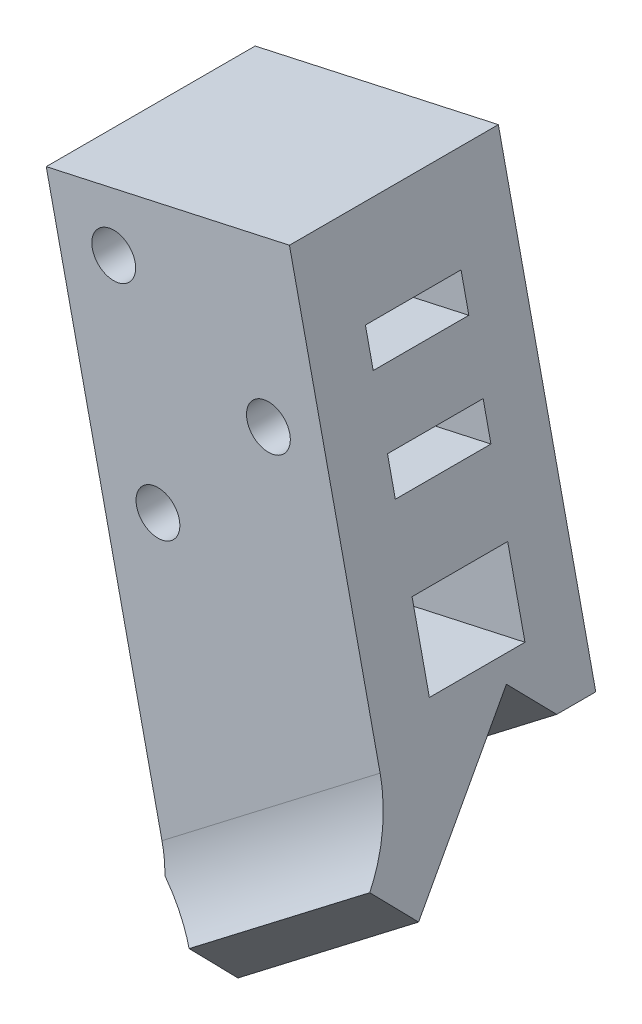
ISO-10303-21;
HEADER;
FILE_DESCRIPTION(('STEP AP214'),'2;1');
FILE_NAME('part.step','',(''),(''),'','','');
FILE_SCHEMA(('AUTOMOTIVE_DESIGN { 1 0 10303 214 1 1 1 1 }'));
ENDSEC;
DATA;
#1=APPLICATION_CONTEXT('core data for automotive mechanical design processes');
#2=APPLICATION_PROTOCOL_DEFINITION('international standard','automotive_design',2000,#1);
#3=PRODUCT_CONTEXT('',#1,'mechanical');
#4=PRODUCT('Part','Part','',(#3));
#5=PRODUCT_RELATED_PRODUCT_CATEGORY('part','',(#4));
#6=PRODUCT_DEFINITION_FORMATION('','',#4);
#7=PRODUCT_DEFINITION_CONTEXT('part definition',#1,'design');
#8=PRODUCT_DEFINITION('design','',#6,#7);
#9=PRODUCT_DEFINITION_SHAPE('','',#8);
#10=(LENGTH_UNIT() NAMED_UNIT(*) SI_UNIT(.MILLI.,.METRE.));
#11=(NAMED_UNIT(*) PLANE_ANGLE_UNIT() SI_UNIT($,.RADIAN.));
#12=(NAMED_UNIT(*) SI_UNIT($,.STERADIAN.) SOLID_ANGLE_UNIT());
#13=UNCERTAINTY_MEASURE_WITH_UNIT(LENGTH_MEASURE(1.E-05),#10,'distance_accuracy_value','');
#14=(GEOMETRIC_REPRESENTATION_CONTEXT(3) GLOBAL_UNCERTAINTY_ASSIGNED_CONTEXT((#13)) GLOBAL_UNIT_ASSIGNED_CONTEXT((#10,
#11,#12)) REPRESENTATION_CONTEXT('',''));
#15=CARTESIAN_POINT('',(0.,0.,0.));
#16=DIRECTION('',(0.,0.,1.));
#17=DIRECTION('',(1.,0.,0.));
#18=AXIS2_PLACEMENT_3D('',#15,#16,#17);
#19=CARTESIAN_POINT('',(-430.644730128089,-3182.63466231102,22.099700245719));
#20=DIRECTION('',(-0.41963660019663,0.5462628016859,0.724915219366848));
#21=DIRECTION('',(0.,-0.798635508908396,0.601815024663416));
#22=AXIS2_PLACEMENT_3D('',#19,#20,#21);
#23=PLANE('',#22);
#24=DIRECTION('',(0.793020599570287,0.609194819952684,-1.14540626299615E-09));
#25=VECTOR('',#24,1.);
#26=CARTESIAN_POINT('',(-430.644730128089,-3182.63466231102,22.099700245719));
#27=LINE('',#26,#25);
#28=CARTESIAN_POINT('',(-431.576719114451,-3183.35061201403,22.0997002470651));
#29=VERTEX_POINT('',#28);
#30=CARTESIAN_POINT('',(-411.328388685969,-3167.79593662165,22.0997002120419));
#31=VERTEX_POINT('',#30);
#32=EDGE_CURVE('E398',#29,#31,#27,.T.);
#33=ORIENTED_EDGE('',*,*,#32,.F.);
#34=DIRECTION('',(0.764332976711528,-0.21811145207351,0.606813394039452));
#35=VECTOR('',#34,1.);
#36=CARTESIAN_POINT('',(-190.519660023296,-3252.1390939884,213.477877875374));
#37=LINE('',#36,#35);
#38=CARTESIAN_POINT('',(-436.818938160454,-3181.85468282867,17.9378377738104));
#39=VERTEX_POINT('',#38);
#40=EDGE_CURVE('E491',#29,#39,#37,.F.);
#41=ORIENTED_EDGE('',*,*,#40,.T.);
#42=DIRECTION('',(-0.162934904586066,0.740330648362003,-0.652198396167475));
#43=VECTOR('',#42,1.);
#44=CARTESIAN_POINT('',(-437.492369636501,-3178.79479849905,15.2422156802948));
#45=LINE('',#44,#43);
#46=CARTESIAN_POINT('',(-439.05748820437,-3171.68333734801,8.9773344860411));
#47=VERTEX_POINT('',#46);
#48=EDGE_CURVE('E390',#39,#47,#45,.T.);
#49=ORIENTED_EDGE('',*,*,#48,.T.);
#50=DIRECTION('',(0.793020599570287,0.609194819952684,-1.14540626299615E-09));
#51=VECTOR('',#50,1.);
#52=CARTESIAN_POINT('',(-439.057488204156,-3171.68333734898,8.9773344860915));
#53=LINE('',#52,#51);
#54=CARTESIAN_POINT('',(-414.606672451435,-3152.90033182925,8.97733445190054));
#55=VERTEX_POINT('',#54);
#56=EDGE_CURVE('E393',#47,#55,#53,.T.);
#57=ORIENTED_EDGE('',*,*,#56,.T.);
#58=DIRECTION('',(-0.162934904566504,0.740330648273025,-0.652198396273363));
#59=VECTOR('',#58,1.);
#60=CARTESIAN_POINT('',(-410.051263001116,-3173.59883863769,27.2117989809765));
#61=LINE('',#60,#59);
#62=EDGE_CURVE('E388',#31,#55,#61,.T.);
#63=ORIENTED_EDGE('',*,*,#62,.F.);
#64=EDGE_LOOP('',(#33,#41,#49,#57,#63));
#65=FACE_BOUND('',#64,.T.);
#66=ADVANCED_FACE('F40',(#65),#23,.F.);
#67=CARTESIAN_POINT('',(730.719316566678,-951.215358792421,1139.78864635279));
#68=DIRECTION('',(-0.441614597168833,0.574872701419261,-0.688838097618251));
#69=DIRECTION('',(0.,0.767760111423423,0.640737396526138));
#70=AXIS2_PLACEMENT_3D('',#67,#68,#69);
#71=PLANE('',#70);
#72=DIRECTION('',(-0.793020599396075,-0.609194820179464,8.44456975149217E-10));
#73=VECTOR('',#72,1.);
#74=CARTESIAN_POINT('',(-407.202840466044,-3159.26737875755,26.572351761195));
#75=LINE('',#74,#73);
#76=CARTESIAN_POINT('',(-412.337314757425,-3163.21165857202,26.5723517666625));
#77=VERTEX_POINT('',#76);
#78=CARTESIAN_POINT('',(-432.585645199395,-3178.76633398893,26.5723517882242));
#79=VERTEX_POINT('',#78);
#80=EDGE_CURVE('E394',#77,#79,#75,.T.);
#81=ORIENTED_EDGE('',*,*,#80,.T.);
#82=DIRECTION('',(0.155610020400119,-0.707048422725113,-0.689831899431307));
#83=VECTOR('',#82,1.);
#84=CARTESIAN_POINT('',(-768.998420111875,-1650.20074884962,1517.91759365708));
#85=LINE('',#84,#83);
#86=EDGE_CURVE('E486',#79,#29,#85,.T.);
#87=ORIENTED_EDGE('',*,*,#86,.T.);
#88=ORIENTED_EDGE('',*,*,#32,.T.);
#89=DIRECTION('',(0.155610020400137,-0.707048422725105,-0.689831899431311));
#90=VECTOR('',#89,1.);
#91=CARTESIAN_POINT('',(-747.529007650291,-1640.19432879024,1512.50443747787));
#92=LINE('',#91,#90);
#93=EDGE_CURVE('E440',#77,#31,#92,.T.);
#94=ORIENTED_EDGE('',*,*,#93,.F.);
#95=EDGE_LOOP('',(#81,#87,#88,#94));
#96=FACE_BOUND('',#95,.T.);
#97=ADVANCED_FACE('F509',(#96),#71,.F.);
#98=CARTESIAN_POINT('',(1369.31075164133,-1782.50307535107,8.97733187412308));
#99=DIRECTION('',(0.441614597168841,-0.574872701419268,0.68883809761824));
#100=DIRECTION('',(-0.793020599570295,-0.609194819952673,1.14542203499823E-09));
#101=AXIS2_PLACEMENT_3D('',#98,#99,#100);
#102=PLANE('',#101);
#103=DIRECTION('',(-0.155610020400138,0.707048422725093,0.689831899431323));
#104=VECTOR('',#103,1.);
#105=CARTESIAN_POINT('',(-419.136446570394,-3132.31830479862,29.0581922017582));
#106=LINE('',#105,#104);
#107=CARTESIAN_POINT('',(-413.56829504717,-3157.61842841449,4.37412281014464));
#108=VERTEX_POINT('',#107);
#109=EDGE_CURVE('E404',#108,#55,#106,.T.);
#110=ORIENTED_EDGE('',*,*,#109,.T.);
#111=ORIENTED_EDGE('',*,*,#56,.F.);
#112=DIRECTION('',(0.155610020400135,-0.707048422725094,-0.689831899431322));
#113=VECTOR('',#112,1.);
#114=CARTESIAN_POINT('',(-444.660319490352,-3146.22563858695,33.8151420926411));
#115=LINE('',#114,#113);
#116=CARTESIAN_POINT('',(-438.01911079961,-3176.4014339355,4.37412284546019));
#117=VERTEX_POINT('',#116);
#118=EDGE_CURVE('E400',#47,#117,#115,.T.);
#119=ORIENTED_EDGE('',*,*,#118,.T.);
#120=DIRECTION('',(0.793020599570291,0.609194819952678,-1.1454154752367E-09));
#121=VECTOR('',#120,1.);
#122=CARTESIAN_POINT('',(-438.019110846727,-3176.40143397169,4.37412284546063));
#123=LINE('',#122,#121);
#124=EDGE_CURVE('E409',#117,#108,#123,.T.);
#125=ORIENTED_EDGE('',*,*,#124,.T.);
#126=EDGE_LOOP('',(#110,#111,#119,#125));
#127=FACE_BOUND('',#126,.T.);
#128=ADVANCED_FACE('F539',(#127),#102,.T.);
#129=CARTESIAN_POINT('',(-424.487246991543,-3108.00576381726,4.3688));
#130=DIRECTION('',(0.214939998904944,-0.97662725585084,0.));
#131=DIRECTION('',(0.97662725585084,0.214939998904944,0.));
#132=AXIS2_PLACEMENT_3D('',#129,#130,#131);
#133=PLANE('',#132);
#134=DIRECTION('',(-0.97662725585084,-0.214939998904944,0.));
#135=VECTOR('',#134,1.);
#136=CARTESIAN_POINT('',(-424.487246991543,-3108.00576381726,0.));
#137=LINE('',#136,#135);
#138=CARTESIAN_POINT('',(-424.487246991543,-3108.00576381726,0.));
#139=VERTEX_POINT('',#138);
#140=CARTESIAN_POINT('',(-451.751312835365,-3114.00614753326,0.));
#141=VERTEX_POINT('',#140);
#142=EDGE_CURVE('E408',#139,#141,#137,.T.);
#143=ORIENTED_EDGE('',*,*,#142,.T.);
#144=DIRECTION('',(0.,0.,-1.));
#145=VECTOR('',#144,1.);
#146=CARTESIAN_POINT('',(-451.751312835365,-3114.00614753326,4.3688));
#147=LINE('',#146,#145);
#148=CARTESIAN_POINT('',(-451.751312835365,-3114.00614753326,23.4188));
#149=VERTEX_POINT('',#148);
#150=EDGE_CURVE('E437',#149,#141,#147,.T.);
#151=ORIENTED_EDGE('',*,*,#150,.F.);
#152=DIRECTION('',(-0.97662725585084,-0.214939998904944,0.));
#153=VECTOR('',#152,1.);
#154=CARTESIAN_POINT('',(-424.487246991543,-3108.00576381726,23.4188));
#155=LINE('',#154,#153);
#156=CARTESIAN_POINT('',(-424.487246991543,-3108.00576381726,23.4188));
#157=VERTEX_POINT('',#156);
#158=EDGE_CURVE('E385',#157,#149,#155,.T.);
#159=ORIENTED_EDGE('',*,*,#158,.F.);
#160=DIRECTION('',(0.,0.,-1.));
#161=VECTOR('',#160,1.);
#162=CARTESIAN_POINT('',(-424.487246991543,-3108.00576381726,4.3688));
#163=LINE('',#162,#161);
#164=EDGE_CURVE('E427',#157,#139,#163,.T.);
#165=ORIENTED_EDGE('',*,*,#164,.T.);
#166=EDGE_LOOP('',(#143,#151,#159,#165));
#167=FACE_BOUND('',#166,.T.);
#168=ADVANCED_FACE('F466',(#167),#133,.F.);
#169=CARTESIAN_POINT('',(-451.751312835365,-3114.00614753326,4.3688));
#170=DIRECTION('',(0.976627255850845,0.214939998904922,0.));
#171=DIRECTION('',(-0.214939998904922,0.976627255850845,0.));
#172=AXIS2_PLACEMENT_3D('',#169,#170,#171);
#173=PLANE('',#172);
#174=DIRECTION('',(0.,0.,1.));
#175=VECTOR('',#174,1.);
#176=CARTESIAN_POINT('',(-447.107596252733,-3135.10589725947,4.3688));
#177=LINE('',#176,#175);
#178=CARTESIAN_POINT('',(-447.107596252733,-3135.10589725947,6.35000000000001));
#179=VERTEX_POINT('',#178);
#180=CARTESIAN_POINT('',(-447.107596252733,-3135.10589725947,17.0688));
#181=VERTEX_POINT('',#180);
#182=EDGE_CURVE('E346',#179,#181,#177,.T.);
#183=ORIENTED_EDGE('',*,*,#182,.T.);
#184=DIRECTION('',(0.214939998904922,-0.976627255850845,0.));
#185=VECTOR('',#184,1.);
#186=CARTESIAN_POINT('',(-451.751312835365,-3114.00614753326,17.0688));
#187=LINE('',#186,#185);
#188=CARTESIAN_POINT('',(-446.232282959902,-3139.08307611655,17.0688));
#189=VERTEX_POINT('',#188);
#190=EDGE_CURVE('E350',#181,#189,#187,.T.);
#191=ORIENTED_EDGE('',*,*,#190,.T.);
#192=DIRECTION('',(0.,0.,-1.));
#193=VECTOR('',#192,1.);
#194=CARTESIAN_POINT('',(-446.232282959902,-3139.08307611655,4.3688));
#195=LINE('',#194,#193);
#196=CARTESIAN_POINT('',(-446.232282959902,-3139.08307611655,6.35000000000001));
#197=VERTEX_POINT('',#196);
#198=EDGE_CURVE('E338',#189,#197,#195,.T.);
#199=ORIENTED_EDGE('',*,*,#198,.T.);
#200=DIRECTION('',(-0.214939998904922,0.976627255850845,0.));
#201=VECTOR('',#200,1.);
#202=CARTESIAN_POINT('',(-451.751312835365,-3114.00614753326,6.35000000000002));
#203=LINE('',#202,#201);
#204=EDGE_CURVE('E342',#197,#179,#203,.T.);
#205=ORIENTED_EDGE('',*,*,#204,.T.);
#206=EDGE_LOOP('',(#183,#191,#199,#205));
#207=FACE_BOUND('',#206,.T.);
#208=DIRECTION('',(0.,0.,1.));
#209=VECTOR('',#208,1.);
#210=CARTESIAN_POINT('',(-444.356952963456,-3147.60405126113,4.3688));
#211=LINE('',#210,#209);
#212=CARTESIAN_POINT('',(-444.356952963456,-3147.60405126113,6.35));
#213=VERTEX_POINT('',#212);
#214=CARTESIAN_POINT('',(-444.356952963456,-3147.60405126113,17.0688));
#215=VERTEX_POINT('',#214);
#216=EDGE_CURVE('E330',#213,#215,#211,.T.);
#217=ORIENTED_EDGE('',*,*,#216,.T.);
#218=DIRECTION('',(0.214939998904922,-0.976627255850845,0.));
#219=VECTOR('',#218,1.);
#220=CARTESIAN_POINT('',(-451.751312835365,-3114.00614753326,17.0688));
#221=LINE('',#220,#219);
#222=CARTESIAN_POINT('',(-442.416685892478,-3156.42008231538,17.0688));
#223=VERTEX_POINT('',#222);
#224=EDGE_CURVE('E334',#215,#223,#221,.T.);
#225=ORIENTED_EDGE('',*,*,#224,.T.);
#226=DIRECTION('',(0.,0.,-1.));
#227=VECTOR('',#226,1.);
#228=CARTESIAN_POINT('',(-442.416685892478,-3156.42008231538,4.3688));
#229=LINE('',#228,#227);
#230=CARTESIAN_POINT('',(-442.416685892478,-3156.42008231538,6.35));
#231=VERTEX_POINT('',#230);
#232=EDGE_CURVE('E325',#223,#231,#229,.T.);
#233=ORIENTED_EDGE('',*,*,#232,.T.);
#234=DIRECTION('',(-0.214939998904922,0.976627255850845,0.));
#235=VECTOR('',#234,1.);
#236=CARTESIAN_POINT('',(-451.751312835365,-3114.00614753326,6.35));
#237=LINE('',#236,#235);
#238=EDGE_CURVE('E223',#231,#213,#237,.T.);
#239=ORIENTED_EDGE('',*,*,#238,.T.);
#240=EDGE_LOOP('',(#217,#225,#233,#239));
#241=FACE_BOUND('',#240,.T.);
#242=DIRECTION('',(0.,0.,1.));
#243=VECTOR('',#242,1.);
#244=CARTESIAN_POINT('',(-449.5852657434,-3123.84805987274,4.3688));
#245=LINE('',#244,#243);
#246=CARTESIAN_POINT('',(-449.5852657434,-3123.84805987274,6.35));
#247=VERTEX_POINT('',#246);
#248=CARTESIAN_POINT('',(-449.5852657434,-3123.84805987274,17.0688));
#249=VERTEX_POINT('',#248);
#250=EDGE_CURVE('E317',#247,#249,#245,.T.);
#251=ORIENTED_EDGE('',*,*,#250,.T.);
#252=DIRECTION('',(0.214939998904922,-0.976627255850845,0.));
#253=VECTOR('',#252,1.);
#254=CARTESIAN_POINT('',(-451.751312835365,-3114.00614753326,17.0688));
#255=LINE('',#254,#253);
#256=CARTESIAN_POINT('',(-448.709952450569,-3127.82523872982,17.0688));
#257=VERTEX_POINT('',#256);
#258=EDGE_CURVE('E321',#249,#257,#255,.T.);
#259=ORIENTED_EDGE('',*,*,#258,.T.);
#260=DIRECTION('',(0.,0.,-1.));
#261=VECTOR('',#260,1.);
#262=CARTESIAN_POINT('',(-448.709952450569,-3127.82523872982,4.3688));
#263=LINE('',#262,#261);
#264=CARTESIAN_POINT('',(-448.709952450569,-3127.82523872982,6.35));
#265=VERTEX_POINT('',#264);
#266=EDGE_CURVE('E300',#257,#265,#263,.T.);
#267=ORIENTED_EDGE('',*,*,#266,.T.);
#268=DIRECTION('',(-0.214939998904922,0.976627255850845,0.));
#269=VECTOR('',#268,1.);
#270=CARTESIAN_POINT('',(-451.751312835365,-3114.00614753326,6.35));
#271=LINE('',#270,#269);
#272=EDGE_CURVE('E313',#265,#247,#271,.T.);
#273=ORIENTED_EDGE('',*,*,#272,.T.);
#274=EDGE_LOOP('',(#251,#259,#267,#273));
#275=FACE_BOUND('',#274,.T.);
#276=ORIENTED_EDGE('',*,*,#48,.F.);
#277=DIRECTION('',(-0.155610020400119,0.707048422725113,0.689831899431307));
#278=VECTOR('',#277,1.);
#279=CARTESIAN_POINT('',(-443.188907776601,-3152.91132199417,46.1764321029431));
#280=LINE('',#279,#278);
#281=CARTESIAN_POINT('',(-438.123350341154,-3175.92779860504,23.7204032534626));
#282=VERTEX_POINT('',#281);
#283=EDGE_CURVE('E54',#39,#282,#280,.T.);
#284=ORIENTED_EDGE('',*,*,#283,.T.);
#285=CARTESIAN_POINT('',(-349.787573346896,-3115.16123150887,26.5723517000558));
#286=CARTESIAN_POINT('',(-351.977187853464,-3112.31089635435,23.4188));
#287=CARTESIAN_POINT('',(-354.890114562926,-3108.51898806292,23.4188));
#288=CARTESIAN_POINT('',(-362.044446407854,-3124.57690568684,26.5723517131077));
#289=CARTESIAN_POINT('',(-364.234060920197,-3121.72657053225,23.4188));
#290=CARTESIAN_POINT('',(-367.146987632947,-3117.93466222909,23.4188));
#291=CARTESIAN_POINT('',(-374.301319468812,-3133.99257986481,26.5723517261596));
#292=CARTESIAN_POINT('',(-376.490933983335,-3131.14224470738,23.4188));
#293=CARTESIAN_POINT('',(-379.403860702968,-3127.35033639527,23.4188));
#294=CARTESIAN_POINT('',(-398.815065590729,-3152.82392822075,26.5723517522633));
#295=CARTESIAN_POINT('',(-401.004680109612,-3149.97359305765,23.4188));
#296=CARTESIAN_POINT('',(-403.917606843008,-3146.18168472762,23.4188));
#297=CARTESIAN_POINT('',(-411.071938651687,-3162.23960239872,26.5723517653152));
#298=CARTESIAN_POINT('',(-413.26155317275,-3159.38926723279,23.4188));
#299=CARTESIAN_POINT('',(-416.174479913029,-3155.59735889379,23.4188));
#300=CARTESIAN_POINT('',(-426.685932250089,-3174.23420131545,26.572351781942));
#301=CARTESIAN_POINT('',(-428.875546770603,-3171.38386614335,23.4188));
#302=CARTESIAN_POINT('',(-431.788473522975,-3167.59195779549,23.4188));
#303=CARTESIAN_POINT('',(-430.043052787532,-3176.81312605421,26.5723517855168));
#304=CARTESIAN_POINT('',(-432.232667308643,-3173.96279088133,23.4188));
#305=CARTESIAN_POINT('',(-435.145594062901,-3170.17088253102,23.4188));
#306=CARTESIAN_POINT('',(-436.757293862419,-3181.97097553173,26.5723517926666));
#307=CARTESIAN_POINT('',(-438.946908384724,-3179.12064035729,23.4188));
#308=CARTESIAN_POINT('',(-441.859835142752,-3175.32873200208,23.4188));
#309=CARTESIAN_POINT('',(-440.114414399862,-3184.54990027049,26.5723517962415));
#310=CARTESIAN_POINT('',(-442.304028922765,-3181.69956509528,23.4188));
#311=CARTESIAN_POINT('',(-445.216955682678,-3177.90765673761,23.4188));
#312=CARTESIAN_POINT('',(-443.471534937306,-3187.12882500925,26.5723517998163));
#313=CARTESIAN_POINT('',(-445.661149460535,-3184.27848983305,23.4188));
#314=CARTESIAN_POINT('',(-448.574076222603,-3180.48658147314,23.4188));
#315=(BOUNDED_SURFACE() B_SPLINE_SURFACE(3,2,((#285,#286,#287),(#288,#289,#290),(#291,#292,
#293),(#294,#295,#296),(#297,#298,#299),(#300,#301,#302),(#303,#304,#305),(#306,#307,#308),
(#309,#310,#311),(#312,#313,#314)),.UNSPECIFIED.,.F.,.F.,.F.) B_SPLINE_SURFACE_WITH_KNOTS((4,2,
2,2,4),(3,3),(0.,46.3677982777214,92.7355965554428,105.435596555442,118.135596555443),(0.,1.),
.UNSPECIFIED.) GEOMETRIC_REPRESENTATION_ITEM() RATIONAL_B_SPLINE_SURFACE(((1.,0.935865599996947,
1.),(1.,0.935865599722404,1.),(1.,0.935865599447875,1.),(1.,0.935865598898816,1.),(1.,
0.935865598624287,1.),(1.,0.935865598274547,1.),(1.,0.93586559819935,1.),(1.,0.935865598048959,
1.),(1.,0.935865597973766,1.),(1.,0.935865597898577,1.))) REPRESENTATION_ITEM('') SURFACE());
#316=CARTESIAN_POINT('',(-436.788130528369,-3181.99466409477,26.5723518123899));
#317=CARTESIAN_POINT('',(-436.85199249223,-3181.70449318737,26.3362950789211));
#318=CARTESIAN_POINT('',(-436.917955252758,-3181.40477684731,26.1126519239133));
#319=CARTESIAN_POINT('',(-437.053530397299,-3180.78876129856,25.6910103711638));
#320=CARTESIAN_POINT('',(-437.123141371937,-3180.47246849366,25.4930021712419));
#321=CARTESIAN_POINT('',(-437.26553527107,-3179.82547043063,25.1232023007172));
#322=CARTESIAN_POINT('',(-437.338319279262,-3179.49476024847,24.9514196786388));
#323=CARTESIAN_POINT('',(-437.486537499552,-3178.82129809863,24.634652831893));
#324=CARTESIAN_POINT('',(-437.561971956061,-3178.47854502041,24.4896710864305));
#325=CARTESIAN_POINT('',(-437.719576337189,-3177.76243478019,24.2190529017237));
#326=CARTESIAN_POINT('',(-437.801879261555,-3177.38847330451,24.0950921670592));
#327=CARTESIAN_POINT('',(-437.968356711557,-3176.6320463203,23.8780480903522));
#328=CARTESIAN_POINT('',(-438.052531538031,-3176.24957944485,23.7849697503444));
#329=CARTESIAN_POINT('',(-438.222038483663,-3175.47938727958,23.6300762332095));
#330=CARTESIAN_POINT('',(-438.307368274327,-3175.09167256979,23.568205664075));
#331=CARTESIAN_POINT('',(-438.47877103715,-3174.31286634129,23.4756387855524));
#332=CARTESIAN_POINT('',(-438.564843568972,-3173.92177682335,23.4449251346116));
#333=CARTESIAN_POINT('',(-438.671926351793,-3173.43522259953,23.4261339715869));
#334=CARTESIAN_POINT('',(-438.692843834221,-3173.34017940809,23.4233825838002));
#335=CARTESIAN_POINT('',(-438.734669983886,-3173.15013307898,23.4197165362036));
#336=CARTESIAN_POINT('',(-438.755578645352,-3173.05512996753,23.4188004515642));
#337=CARTESIAN_POINT('',(-438.776488933922,-3172.96011946298,23.4188));
#338=B_SPLINE_CURVE_WITH_KNOTS('',3,(#316,#317,#318,#319,#320,#321,#322,#323,#324,#325,#326,
#327,#328,#329,#330,#331,#332,#333,#334,#335,#336,#337),.UNSPECIFIED.,.F.,.F.,(4,2,2,2,2,2,2,2,
2,2,4),(0.,1.13799363054312,2.27555082679134,3.41349962790778,4.55155364192665,5.75767553139236,
6.96399268167547,8.16816108646253,9.37165889776451,9.66371918446454,9.95555264345879),.UNSPECIFIED.);
#339=CARTESIAN_POINT('',(-438.776488933922,-3172.96011946298,23.4188));
#340=VERTEX_POINT('',#339);
#341=EDGE_CURVE('E453',#282,#340,#338,.T.);
#342=ORIENTED_EDGE('',*,*,#341,.T.);
#343=DIRECTION('',(0.214939998904921,-0.976627255850845,0.));
#344=VECTOR('',#343,1.);
#345=CARTESIAN_POINT('',(-451.751312835365,-3114.00614753326,23.4188));
#346=LINE('',#345,#344);
#347=EDGE_CURVE('E378',#149,#340,#346,.T.);
#348=ORIENTED_EDGE('',*,*,#347,.F.);
#349=ORIENTED_EDGE('',*,*,#150,.T.);
#350=DIRECTION('',(0.214939998904922,-0.976627255850845,0.));
#351=VECTOR('',#350,1.);
#352=CARTESIAN_POINT('',(-451.751312835365,-3114.00614753326,0.));
#353=LINE('',#352,#351);
#354=CARTESIAN_POINT('',(-438.01911079961,-3176.4014339355,0.));
#355=VERTEX_POINT('',#354);
#356=EDGE_CURVE('E417',#141,#355,#353,.T.);
#357=ORIENTED_EDGE('',*,*,#356,.T.);
#358=DIRECTION('',(0.,0.,-1.));
#359=VECTOR('',#358,1.);
#360=CARTESIAN_POINT('',(-438.01911079961,-3176.4014339355,4.3688));
#361=LINE('',#360,#359);
#362=EDGE_CURVE('E433',#117,#355,#361,.T.);
#363=ORIENTED_EDGE('',*,*,#362,.F.);
#364=ORIENTED_EDGE('',*,*,#118,.F.);
#365=EDGE_LOOP('',(#276,#284,#342,#348,#349,#357,#363,#364));
#366=FACE_BOUND('',#365,.T.);
#367=ADVANCED_FACE('F497',(#207,#241,#275,#366),#173,.F.);
#368=CARTESIAN_POINT('',(-413.56829504717,-3157.61842841449,4.3688));
#369=DIRECTION('',(-0.609194819952676,0.793020599570293,0.));
#370=DIRECTION('',(-0.793020599570293,-0.609194819952676,0.));
#371=AXIS2_PLACEMENT_3D('',#368,#369,#370);
#372=PLANE('',#371);
#373=DIRECTION('',(0.793020599570293,0.609194819952676,0.));
#374=VECTOR('',#373,1.);
#375=CARTESIAN_POINT('',(-413.56829504717,-3157.61842841449,0.));
#376=LINE('',#375,#374);
#377=CARTESIAN_POINT('',(-413.56829504717,-3157.61842841449,0.));
#378=VERTEX_POINT('',#377);
#379=EDGE_CURVE('E420',#355,#378,#376,.T.);
#380=ORIENTED_EDGE('',*,*,#379,.T.);
#381=DIRECTION('',(0.,0.,-1.));
#382=VECTOR('',#381,1.);
#383=CARTESIAN_POINT('',(-413.56829504717,-3157.61842841449,4.3688));
#384=LINE('',#383,#382);
#385=EDGE_CURVE('E430',#108,#378,#384,.T.);
#386=ORIENTED_EDGE('',*,*,#385,.F.);
#387=ORIENTED_EDGE('',*,*,#124,.F.);
#388=ORIENTED_EDGE('',*,*,#362,.T.);
#389=EDGE_LOOP('',(#380,#386,#387,#388));
#390=FACE_BOUND('',#389,.T.);
#391=ADVANCED_FACE('F528',(#390),#372,.F.);
#392=CARTESIAN_POINT('',(-413.56829504717,-3157.61842841449,4.3688));
#393=DIRECTION('',(-0.976627255850839,-0.21493999890495,0.));
#394=DIRECTION('',(0.21493999890495,-0.976627255850839,0.));
#395=AXIS2_PLACEMENT_3D('',#392,#393,#394);
#396=PLANE('',#395);
#397=DIRECTION('',(0.,0.,-1.));
#398=VECTOR('',#397,1.);
#399=CARTESIAN_POINT('',(-418.96821711608,-3133.08269240055,17.0688));
#400=LINE('',#399,#398);
#401=CARTESIAN_POINT('',(-418.96821711608,-3133.08269240055,17.0688));
#402=VERTEX_POINT('',#401);
#403=CARTESIAN_POINT('',(-418.96821711608,-3133.08269240055,6.35000000000001));
#404=VERTEX_POINT('',#403);
#405=EDGE_CURVE('E260',#402,#404,#400,.T.);
#406=ORIENTED_EDGE('',*,*,#405,.F.);
#407=DIRECTION('',(0.214939998904933,-0.976627255850843,0.));
#408=VECTOR('',#407,1.);
#409=CARTESIAN_POINT('',(-418.96821711608,-3133.08269240055,17.0688));
#410=LINE('',#409,#408);
#411=CARTESIAN_POINT('',(-419.843530408911,-3129.10551354346,17.0688));
#412=VERTEX_POINT('',#411);
#413=EDGE_CURVE('E253',#412,#402,#410,.T.);
#414=ORIENTED_EDGE('',*,*,#413,.F.);
#415=DIRECTION('',(0.,0.,1.));
#416=VECTOR('',#415,1.);
#417=CARTESIAN_POINT('',(-419.843530408911,-3129.10551354346,17.0688));
#418=LINE('',#417,#416);
#419=CARTESIAN_POINT('',(-419.843530408911,-3129.10551354346,6.35000000000001));
#420=VERTEX_POINT('',#419);
#421=EDGE_CURVE('E267',#420,#412,#418,.T.);
#422=ORIENTED_EDGE('',*,*,#421,.F.);
#423=DIRECTION('',(-0.214939998904933,0.976627255850843,0.));
#424=VECTOR('',#423,1.);
#425=CARTESIAN_POINT('',(-418.96821711608,-3133.08269240055,6.35000000000001));
#426=LINE('',#425,#424);
#427=EDGE_CURVE('E263',#404,#420,#426,.T.);
#428=ORIENTED_EDGE('',*,*,#427,.F.);
#429=EDGE_LOOP('',(#406,#414,#422,#428));
#430=FACE_BOUND('',#429,.T.);
#431=DIRECTION('',(0.,0.,-1.));
#432=VECTOR('',#431,1.);
#433=CARTESIAN_POINT('',(-415.152620048655,-3150.41969859938,17.0688));
#434=LINE('',#433,#432);
#435=CARTESIAN_POINT('',(-415.152620048655,-3150.41969859938,17.0688));
#436=VERTEX_POINT('',#435);
#437=CARTESIAN_POINT('',(-415.152620048655,-3150.41969859938,6.35));
#438=VERTEX_POINT('',#437);
#439=EDGE_CURVE('E231',#436,#438,#434,.T.);
#440=ORIENTED_EDGE('',*,*,#439,.F.);
#441=DIRECTION('',(0.214939998904948,-0.976627255850839,0.));
#442=VECTOR('',#441,1.);
#443=CARTESIAN_POINT('',(-415.152620048655,-3150.41969859938,17.0688));
#444=LINE('',#443,#442);
#445=CARTESIAN_POINT('',(-417.092887119634,-3141.60366754512,17.0688));
#446=VERTEX_POINT('',#445);
#447=EDGE_CURVE('E237',#446,#436,#444,.T.);
#448=ORIENTED_EDGE('',*,*,#447,.F.);
#449=DIRECTION('',(0.,0.,1.));
#450=VECTOR('',#449,1.);
#451=CARTESIAN_POINT('',(-417.092887119634,-3141.60366754512,17.0688));
#452=LINE('',#451,#450);
#453=CARTESIAN_POINT('',(-417.092887119634,-3141.60366754512,6.35));
#454=VERTEX_POINT('',#453);
#455=EDGE_CURVE('E242',#454,#446,#452,.T.);
#456=ORIENTED_EDGE('',*,*,#455,.F.);
#457=DIRECTION('',(-0.214939998904948,0.976627255850839,0.));
#458=VECTOR('',#457,1.);
#459=CARTESIAN_POINT('',(-415.152620048655,-3150.41969859938,6.35));
#460=LINE('',#459,#458);
#461=EDGE_CURVE('E220',#438,#454,#460,.T.);
#462=ORIENTED_EDGE('',*,*,#461,.F.);
#463=EDGE_LOOP('',(#440,#448,#456,#462));
#464=FACE_BOUND('',#463,.T.);
#465=DIRECTION('',(0.,0.,-1.));
#466=VECTOR('',#465,1.);
#467=CARTESIAN_POINT('',(-421.445886606748,-3121.82485501382,17.0688));
#468=LINE('',#467,#466);
#469=CARTESIAN_POINT('',(-421.445886606747,-3121.82485501382,17.0688));
#470=VERTEX_POINT('',#469);
#471=CARTESIAN_POINT('',(-421.445886606748,-3121.82485501382,6.35));
#472=VERTEX_POINT('',#471);
#473=EDGE_CURVE('E285',#470,#472,#468,.T.);
#474=ORIENTED_EDGE('',*,*,#473,.F.);
#475=DIRECTION('',(0.214939998904959,-0.976627255850837,0.));
#476=VECTOR('',#475,1.);
#477=CARTESIAN_POINT('',(-421.445886606748,-3121.82485501382,17.0688));
#478=LINE('',#477,#476);
#479=CARTESIAN_POINT('',(-422.321199899578,-3117.84767615673,17.0688));
#480=VERTEX_POINT('',#479);
#481=EDGE_CURVE('E275',#480,#470,#478,.T.);
#482=ORIENTED_EDGE('',*,*,#481,.F.);
#483=DIRECTION('',(0.,0.,1.));
#484=VECTOR('',#483,1.);
#485=CARTESIAN_POINT('',(-422.321199899578,-3117.84767615673,17.0688));
#486=LINE('',#485,#484);
#487=CARTESIAN_POINT('',(-422.321199899578,-3117.84767615673,6.35));
#488=VERTEX_POINT('',#487);
#489=EDGE_CURVE('E293',#488,#480,#486,.T.);
#490=ORIENTED_EDGE('',*,*,#489,.F.);
#491=DIRECTION('',(-0.214939998904959,0.976627255850837,0.));
#492=VECTOR('',#491,1.);
#493=CARTESIAN_POINT('',(-421.445886606748,-3121.82485501382,6.35));
#494=LINE('',#493,#492);
#495=EDGE_CURVE('E289',#472,#488,#494,.T.);
#496=ORIENTED_EDGE('',*,*,#495,.F.);
#497=EDGE_LOOP('',(#474,#482,#490,#496));
#498=FACE_BOUND('',#497,.T.);
#499=DIRECTION('',(-0.214939998904949,0.976627255850839,0.));
#500=VECTOR('',#499,1.);
#501=CARTESIAN_POINT('',(-416.37686485505,-3144.85707250907,23.4188));
#502=LINE('',#501,#500);
#503=CARTESIAN_POINT('',(-414.325673176531,-3154.17711396447,23.4188));
#504=VERTEX_POINT('',#503);
#505=EDGE_CURVE('E382',#504,#157,#502,.T.);
#506=ORIENTED_EDGE('',*,*,#505,.F.);
#507=CARTESIAN_POINT('',(-414.325673176531,-3154.17711396447,23.4188));
#508=CARTESIAN_POINT('',(-414.243345869296,-3154.55118622908,23.4187900429497));
#509=CARTESIAN_POINT('',(-414.161016945508,-3154.92526583886,23.4330050444115));
#510=CARTESIAN_POINT('',(-413.996783730584,-3155.67149564637,23.4898247725265));
#511=CARTESIAN_POINT('',(-413.914879600851,-3156.04364511074,23.5324395923262));
#512=CARTESIAN_POINT('',(-413.753995211551,-3156.77465879099,23.644595942228));
#513=CARTESIAN_POINT('',(-413.674992706797,-3157.13362408277,23.713446241035));
#514=CARTESIAN_POINT('',(-413.518315956835,-3157.84551942636,23.8779212823023));
#515=CARTESIAN_POINT('',(-413.440641268725,-3158.19845149058,23.9735369045293));
#516=CARTESIAN_POINT('',(-413.27240369998,-3158.96287596221,24.2121038503853));
#517=CARTESIAN_POINT('',(-413.182200838069,-3159.3727325452,24.3606003437999));
#518=CARTESIAN_POINT('',(-413.005031607829,-3160.17773998928,24.6947638739274));
#519=CARTESIAN_POINT('',(-412.918065347256,-3160.57289036077,24.8804321468956));
#520=CARTESIAN_POINT('',(-412.745610971719,-3161.35647482341,25.2943726707449));
#521=CARTESIAN_POINT('',(-412.660245688798,-3161.74435080009,25.5237569634203));
#522=CARTESIAN_POINT('',(-412.494668818253,-3162.49668580305,26.0201462353488));
#523=CARTESIAN_POINT('',(-412.414459992932,-3162.86113227819,26.2871711380699));
#524=CARTESIAN_POINT('',(-412.337314775076,-3163.21165857763,26.572351761132));
#525=B_SPLINE_CURVE_WITH_KNOTS('',3,(#507,#508,#509,#510,#511,#512,#513,#514,#515,#516,#517,
#518,#519,#520,#521,#522,#523,#524),.UNSPECIFIED.,.F.,.F.,(4,2,2,2,2,2,2,2,4),(0.,
1.14882360942537,2.29805572261687,3.41889615482563,4.53935512671144,5.87301886800987,
7.20672697152752,8.58048972822781,9.95498237786703),.UNSPECIFIED.);
#526=EDGE_CURVE('E492',#504,#77,#525,.T.);
#527=ORIENTED_EDGE('',*,*,#526,.T.);
#528=ORIENTED_EDGE('',*,*,#93,.T.);
#529=ORIENTED_EDGE('',*,*,#62,.T.);
#530=ORIENTED_EDGE('',*,*,#109,.F.);
#531=ORIENTED_EDGE('',*,*,#385,.T.);
#532=DIRECTION('',(-0.21493999890495,0.976627255850839,0.));
#533=VECTOR('',#532,1.);
#534=CARTESIAN_POINT('',(-413.56829504717,-3157.61842841449,0.));
#535=LINE('',#534,#533);
#536=EDGE_CURVE('E424',#378,#139,#535,.T.);
#537=ORIENTED_EDGE('',*,*,#536,.T.);
#538=ORIENTED_EDGE('',*,*,#164,.F.);
#539=EDGE_LOOP('',(#506,#527,#528,#529,#530,#531,#537,#538));
#540=FACE_BOUND('',#539,.T.);
#541=ADVANCED_FACE('F239',(#430,#464,#498,#540),#396,.F.);
#542=CARTESIAN_POINT('',(0.,0.,0.));
#543=DIRECTION('',(0.,0.,1.));
#544=DIRECTION('',(1.,0.,0.));
#545=AXIS2_PLACEMENT_3D('',#542,#543,#544);
#546=PLANE('',#545);
#547=CARTESIAN_POINT('',(-439.229521786332,-3141.35853638832,0.));
#548=DIRECTION('',(0.,0.,1.));
#549=DIRECTION('',(1.,0.,0.));
#550=AXIS2_PLACEMENT_3D('',#547,#548,#549);
#551=CIRCLE('',#550,2.45744999999997);
#552=CARTESIAN_POINT('',(-436.772071786332,-3141.35853638832,0.));
#553=VERTEX_POINT('',#552);
#554=EDGE_CURVE('E358',#553,#553,#551,.T.);
#555=ORIENTED_EDGE('',*,*,#554,.T.);
#556=EDGE_LOOP('',(#555));
#557=FACE_BOUND('',#556,.T.);
#558=CARTESIAN_POINT('',(-444.184860767666,-3118.84286161487,0.));
#559=DIRECTION('',(0.,0.,1.));
#560=DIRECTION('',(1.,0.,0.));
#561=AXIS2_PLACEMENT_3D('',#558,#559,#560);
#562=CIRCLE('',#561,2.45744999999997);
#563=CARTESIAN_POINT('',(-441.727410767666,-3118.84286161487,0.));
#564=VERTEX_POINT('',#563);
#565=EDGE_CURVE('E366',#564,#564,#562,.T.);
#566=ORIENTED_EDGE('',*,*,#565,.T.);
#567=EDGE_LOOP('',(#566));
#568=FACE_BOUND('',#567,.T.);
#569=CARTESIAN_POINT('',(-426.846291582482,-3126.83005327168,0.));
#570=DIRECTION('',(0.,0.,1.));
#571=DIRECTION('',(1.,0.,0.));
#572=AXIS2_PLACEMENT_3D('',#569,#570,#571);
#573=CIRCLE('',#572,2.45744999999997);
#574=CARTESIAN_POINT('',(-424.388841582483,-3126.83005327168,0.));
#575=VERTEX_POINT('',#574);
#576=EDGE_CURVE('E374',#575,#575,#573,.T.);
#577=ORIENTED_EDGE('',*,*,#576,.T.);
#578=EDGE_LOOP('',(#577));
#579=FACE_BOUND('',#578,.T.);
#580=ORIENTED_EDGE('',*,*,#142,.F.);
#581=ORIENTED_EDGE('',*,*,#536,.F.);
#582=ORIENTED_EDGE('',*,*,#379,.F.);
#583=ORIENTED_EDGE('',*,*,#356,.F.);
#584=EDGE_LOOP('',(#580,#581,#582,#583));
#585=FACE_BOUND('',#584,.T.);
#586=ADVANCED_FACE('F527',(#557,#568,#579,#585),#546,.F.);
#587=CARTESIAN_POINT('',(0.,0.,23.4188));
#588=DIRECTION('',(0.,0.,-1.));
#589=DIRECTION('',(-1.,0.,0.));
#590=AXIS2_PLACEMENT_3D('',#587,#588,#589);
#591=PLANE('',#590);
#592=CARTESIAN_POINT('',(-439.229521786332,-3141.35853638832,23.4188));
#593=DIRECTION('',(0.,0.,1.));
#594=DIRECTION('',(1.,0.,0.));
#595=AXIS2_PLACEMENT_3D('',#592,#593,#594);
#596=CIRCLE('',#595,2.45744999999997);
#597=CARTESIAN_POINT('',(-436.772071786332,-3141.35853638832,23.4188));
#598=VERTEX_POINT('',#597);
#599=EDGE_CURVE('E354',#598,#598,#596,.T.);
#600=ORIENTED_EDGE('',*,*,#599,.F.);
#601=EDGE_LOOP('',(#600));
#602=FACE_BOUND('',#601,.T.);
#603=CARTESIAN_POINT('',(-444.184860767666,-3118.84286161487,23.4188));
#604=DIRECTION('',(0.,0.,1.));
#605=DIRECTION('',(1.,0.,0.));
#606=AXIS2_PLACEMENT_3D('',#603,#604,#605);
#607=CIRCLE('',#606,2.45744999999997);
#608=CARTESIAN_POINT('',(-441.727410767666,-3118.84286161487,23.4188));
#609=VERTEX_POINT('',#608);
#610=EDGE_CURVE('E362',#609,#609,#607,.T.);
#611=ORIENTED_EDGE('',*,*,#610,.F.);
#612=EDGE_LOOP('',(#611));
#613=FACE_BOUND('',#612,.T.);
#614=CARTESIAN_POINT('',(-426.846291582482,-3126.83005327168,23.4188));
#615=DIRECTION('',(0.,0.,1.));
#616=DIRECTION('',(1.,0.,0.));
#617=AXIS2_PLACEMENT_3D('',#614,#615,#616);
#618=CIRCLE('',#617,2.45744999999997);
#619=CARTESIAN_POINT('',(-424.388841582483,-3126.83005327168,23.4188));
#620=VERTEX_POINT('',#619);
#621=EDGE_CURVE('E370',#620,#620,#618,.T.);
#622=ORIENTED_EDGE('',*,*,#621,.F.);
#623=EDGE_LOOP('',(#622));
#624=FACE_BOUND('',#623,.T.);
#625=ORIENTED_EDGE('',*,*,#347,.T.);
#626=CARTESIAN_POINT('',(-448.574076222603,-3180.48658147314,23.4188));
#627=CARTESIAN_POINT('',(-445.216955682678,-3177.90765673761,23.4188));
#628=CARTESIAN_POINT('',(-441.859835142752,-3175.32873200208,23.4188));
#629=CARTESIAN_POINT('',(-435.145594062901,-3170.17088253102,23.4188));
#630=CARTESIAN_POINT('',(-431.788473522975,-3167.59195779549,23.4188));
#631=CARTESIAN_POINT('',(-416.174479913029,-3155.59735889379,23.4188));
#632=CARTESIAN_POINT('',(-403.917606843008,-3146.18168472762,23.4188));
#633=CARTESIAN_POINT('',(-379.403860702968,-3127.35033639527,23.4188));
#634=CARTESIAN_POINT('',(-367.146987632947,-3117.93466222909,23.4188));
#635=CARTESIAN_POINT('',(-354.890114562926,-3108.51898806292,23.4188));
#636=B_SPLINE_CURVE_WITH_KNOTS('',3,(#626,#627,#628,#629,#630,#631,#632,#633,#634,#635),
.UNSPECIFIED.,.F.,.F.,(4,2,2,2,4),(0.,12.7000000000003,25.3999999999999,71.7677982777213,
118.135596555443),.UNSPECIFIED.);
#637=EDGE_CURVE('E444',#340,#504,#636,.T.);
#638=ORIENTED_EDGE('',*,*,#637,.T.);
#639=ORIENTED_EDGE('',*,*,#505,.T.);
#640=ORIENTED_EDGE('',*,*,#158,.T.);
#641=EDGE_LOOP('',(#625,#638,#639,#640));
#642=FACE_BOUND('',#641,.T.);
#643=ADVANCED_FACE('F460',(#602,#613,#624,#642),#591,.F.);
#644=ORIENTED_EDGE('',*,*,#341,.F.);
#645=CARTESIAN_POINT('',(-438.123350341154,-3175.92779860504,23.7204032534626));
#646=CARTESIAN_POINT('',(-437.817714554552,-3176.14756343867,23.8003529499863));
#647=CARTESIAN_POINT('',(-437.509231929457,-3176.35756656795,23.895542123224));
#648=CARTESIAN_POINT('',(-436.889371681759,-3176.75721591874,24.1142203098097));
#649=CARTESIAN_POINT('',(-436.577995827056,-3176.946873784,24.2376930080501));
#650=CARTESIAN_POINT('',(-435.960929000601,-3177.30172339922,24.508165194089));
#651=CARTESIAN_POINT('',(-435.655246886453,-3177.46732354784,24.6546532513524));
#652=CARTESIAN_POINT('',(-435.045541487021,-3177.77810360395,24.9707965279551));
#653=CARTESIAN_POINT('',(-434.741517955827,-3177.92328662227,25.1404482102055));
#654=CARTESIAN_POINT('',(-434.283136552739,-3178.12789231772,25.4137744164343));
#655=CARTESIAN_POINT('',(-434.127447494883,-3178.19485553751,25.5097162968912));
#656=CARTESIAN_POINT('',(-433.817261172777,-3178.32329628529,25.7069699306659));
#657=CARTESIAN_POINT('',(-433.662763615858,-3178.3847752023,25.8082803138559));
#658=CARTESIAN_POINT('',(-433.353540074362,-3178.50288447833,26.0171138876937));
#659=CARTESIAN_POINT('',(-433.198828626267,-3178.55945734997,26.1246910097568));
#660=CARTESIAN_POINT('',(-432.890989858988,-3178.66705552235,26.3448421773049));
#661=CARTESIAN_POINT('',(-432.737862855935,-3178.7180797346,26.457417197151));
#662=CARTESIAN_POINT('',(-432.585645199395,-3178.76633398893,26.5723517882247));
#663=B_SPLINE_CURVE_WITH_KNOTS('',3,(#645,#646,#647,#648,#649,#650,#651,#652,#653,#654,#655,
#656,#657,#658,#659,#660,#661,#662),.UNSPECIFIED.,.F.,.F.,(4,2,2,2,2,2,2,2,4),(0.,
1.15387844155968,2.30709294698867,3.43758773502796,4.56791008900976,5.15203585954057,
5.73601326317833,6.32610334833828,6.91630898358811),.UNSPECIFIED.);
#664=EDGE_CURVE('E11',#282,#79,#663,.T.);
#665=ORIENTED_EDGE('',*,*,#664,.T.);
#666=ORIENTED_EDGE('',*,*,#80,.F.);
#667=ORIENTED_EDGE('',*,*,#526,.F.);
#668=ORIENTED_EDGE('',*,*,#637,.F.);
#669=EDGE_LOOP('',(#644,#665,#666,#667,#668));
#670=FACE_BOUND('',#669,.T.);
#671=ADVANCED_FACE('F467',(#670),#315,.F.);
#672=CARTESIAN_POINT('',(-768.998420111876,-1650.20074884962,1517.91759365708));
#673=DIRECTION('',(0.585735287923843,0.628369475083914,-0.511923798297696));
#674=DIRECTION('',(0.155610020400119,-0.707048422725113,-0.689831899431307));
#675=AXIS2_PLACEMENT_3D('',#672,#673,#674);
#676=PLANE('',#675);
#677=ORIENTED_EDGE('',*,*,#664,.F.);
#678=ORIENTED_EDGE('',*,*,#283,.F.);
#679=ORIENTED_EDGE('',*,*,#40,.F.);
#680=ORIENTED_EDGE('',*,*,#86,.F.);
#681=EDGE_LOOP('',(#677,#678,#679,#680));
#682=FACE_BOUND('',#681,.T.);
#683=ADVANCED_FACE('F42',(#682),#676,.F.);
#684=CARTESIAN_POINT('',(-426.846291582482,-3126.83005327168,23.4188));
#685=DIRECTION('',(0.,0.,1.));
#686=DIRECTION('',(1.,0.,0.));
#687=AXIS2_PLACEMENT_3D('',#684,#685,#686);
#688=CYLINDRICAL_SURFACE('',#687,2.45744999999997);
#689=ORIENTED_EDGE('',*,*,#576,.F.);
#690=EDGE_LOOP('',(#689));
#691=FACE_BOUND('',#690,.T.);
#692=ORIENTED_EDGE('',*,*,#621,.T.);
#693=EDGE_LOOP('',(#692));
#694=FACE_BOUND('',#693,.T.);
#695=ADVANCED_FACE('F574',(#691,#694),#688,.F.);
#696=CARTESIAN_POINT('',(-444.184860767666,-3118.84286161487,23.4188));
#697=DIRECTION('',(0.,0.,1.));
#698=DIRECTION('',(1.,0.,0.));
#699=AXIS2_PLACEMENT_3D('',#696,#697,#698);
#700=CYLINDRICAL_SURFACE('',#699,2.45744999999997);
#701=ORIENTED_EDGE('',*,*,#565,.F.);
#702=EDGE_LOOP('',(#701));
#703=FACE_BOUND('',#702,.T.);
#704=ORIENTED_EDGE('',*,*,#610,.T.);
#705=EDGE_LOOP('',(#704));
#706=FACE_BOUND('',#705,.T.);
#707=ADVANCED_FACE('F576',(#703,#706),#700,.F.);
#708=CARTESIAN_POINT('',(-439.229521786332,-3141.35853638832,23.4188));
#709=DIRECTION('',(0.,0.,1.));
#710=DIRECTION('',(1.,0.,0.));
#711=AXIS2_PLACEMENT_3D('',#708,#709,#710);
#712=CYLINDRICAL_SURFACE('',#711,2.45744999999997);
#713=ORIENTED_EDGE('',*,*,#554,.F.);
#714=EDGE_LOOP('',(#713));
#715=FACE_BOUND('',#714,.T.);
#716=ORIENTED_EDGE('',*,*,#599,.T.);
#717=EDGE_LOOP('',(#716));
#718=FACE_BOUND('',#717,.T.);
#719=ADVANCED_FACE('F582',(#715,#718),#712,.F.);
#720=CARTESIAN_POINT('',(-463.266483176439,-3131.02889773026,17.0688));
#721=DIRECTION('',(0.,0.,1.));
#722=DIRECTION('',(1.,0.,0.));
#723=AXIS2_PLACEMENT_3D('',#720,#721,#722);
#724=PLANE('',#723);
#725=DIRECTION('',(0.976627255850839,0.21493999890495,0.));
#726=VECTOR('',#725,1.);
#727=CARTESIAN_POINT('',(-464.14179646927,-3127.05171887317,17.0688));
#728=LINE('',#727,#726);
#729=EDGE_CURVE('E297',#249,#480,#728,.T.);
#730=ORIENTED_EDGE('',*,*,#729,.T.);
#731=ORIENTED_EDGE('',*,*,#481,.T.);
#732=DIRECTION('',(0.976627255850839,0.21493999890495,0.));
#733=VECTOR('',#732,1.);
#734=CARTESIAN_POINT('',(-463.266483176439,-3131.02889773026,17.0688));
#735=LINE('',#734,#733);
#736=EDGE_CURVE('E296',#257,#470,#735,.T.);
#737=ORIENTED_EDGE('',*,*,#736,.F.);
#738=ORIENTED_EDGE('',*,*,#258,.F.);
#739=EDGE_LOOP('',(#730,#731,#737,#738));
#740=FACE_BOUND('',#739,.T.);
#741=ADVANCED_FACE('F589',(#740),#724,.F.);
#742=CARTESIAN_POINT('',(-464.14179646927,-3127.05171887317,17.0688));
#743=DIRECTION('',(-0.21493999890495,0.976627255850839,0.));
#744=DIRECTION('',(-0.976627255850839,-0.21493999890495,0.));
#745=AXIS2_PLACEMENT_3D('',#742,#743,#744);
#746=PLANE('',#745);
#747=DIRECTION('',(0.976627255850839,0.21493999890495,0.));
#748=VECTOR('',#747,1.);
#749=CARTESIAN_POINT('',(-464.14179646927,-3127.05171887317,6.35));
#750=LINE('',#749,#748);
#751=EDGE_CURVE('E301',#247,#488,#750,.T.);
#752=ORIENTED_EDGE('',*,*,#751,.T.);
#753=ORIENTED_EDGE('',*,*,#489,.T.);
#754=ORIENTED_EDGE('',*,*,#729,.F.);
#755=ORIENTED_EDGE('',*,*,#250,.F.);
#756=EDGE_LOOP('',(#752,#753,#754,#755));
#757=FACE_BOUND('',#756,.T.);
#758=ADVANCED_FACE('F593',(#757),#746,.F.);
#759=CARTESIAN_POINT('',(-463.266483176439,-3131.02889773026,6.35));
#760=DIRECTION('',(0.,0.,-1.));
#761=DIRECTION('',(-1.,0.,0.));
#762=AXIS2_PLACEMENT_3D('',#759,#760,#761);
#763=PLANE('',#762);
#764=DIRECTION('',(0.976627255850839,0.21493999890495,0.));
#765=VECTOR('',#764,1.);
#766=CARTESIAN_POINT('',(-463.266483176439,-3131.02889773026,6.35));
#767=LINE('',#766,#765);
#768=EDGE_CURVE('E304',#265,#472,#767,.T.);
#769=ORIENTED_EDGE('',*,*,#768,.T.);
#770=ORIENTED_EDGE('',*,*,#495,.T.);
#771=ORIENTED_EDGE('',*,*,#751,.F.);
#772=ORIENTED_EDGE('',*,*,#272,.F.);
#773=EDGE_LOOP('',(#769,#770,#771,#772));
#774=FACE_BOUND('',#773,.T.);
#775=ADVANCED_FACE('F599',(#774),#763,.F.);
#776=CARTESIAN_POINT('',(-463.266483176439,-3131.02889773026,17.0688));
#777=DIRECTION('',(0.21493999890495,-0.976627255850839,0.));
#778=DIRECTION('',(0.976627255850839,0.21493999890495,0.));
#779=AXIS2_PLACEMENT_3D('',#776,#777,#778);
#780=PLANE('',#779);
#781=ORIENTED_EDGE('',*,*,#736,.T.);
#782=ORIENTED_EDGE('',*,*,#473,.T.);
#783=ORIENTED_EDGE('',*,*,#768,.F.);
#784=ORIENTED_EDGE('',*,*,#266,.F.);
#785=EDGE_LOOP('',(#781,#782,#783,#784));
#786=FACE_BOUND('',#785,.T.);
#787=ADVANCED_FACE('F595',(#786),#780,.F.);
#788=CARTESIAN_POINT('',(-456.973216618347,-3159.62374131582,17.0688));
#789=DIRECTION('',(0.,0.,1.));
#790=DIRECTION('',(1.,0.,0.));
#791=AXIS2_PLACEMENT_3D('',#788,#789,#790);
#792=PLANE('',#791);
#793=DIRECTION('',(0.976627255850839,0.21493999890495,0.));
#794=VECTOR('',#793,1.);
#795=CARTESIAN_POINT('',(-458.913483689325,-3150.80771026156,17.0688));
#796=LINE('',#795,#794);
#797=EDGE_CURVE('E250',#215,#446,#796,.T.);
#798=ORIENTED_EDGE('',*,*,#797,.T.);
#799=ORIENTED_EDGE('',*,*,#447,.T.);
#800=DIRECTION('',(0.976627255850839,0.21493999890495,0.));
#801=VECTOR('',#800,1.);
#802=CARTESIAN_POINT('',(-456.973216618347,-3159.62374131582,17.0688));
#803=LINE('',#802,#801);
#804=EDGE_CURVE('E227',#223,#436,#803,.T.);
#805=ORIENTED_EDGE('',*,*,#804,.F.);
#806=ORIENTED_EDGE('',*,*,#224,.F.);
#807=EDGE_LOOP('',(#798,#799,#805,#806));
#808=FACE_BOUND('',#807,.T.);
#809=ADVANCED_FACE('F598',(#808),#792,.F.);
#810=CARTESIAN_POINT('',(-458.913483689325,-3150.80771026156,17.0688));
#811=DIRECTION('',(-0.21493999890495,0.976627255850839,0.));
#812=DIRECTION('',(-0.976627255850839,-0.21493999890495,0.));
#813=AXIS2_PLACEMENT_3D('',#810,#811,#812);
#814=PLANE('',#813);
#815=DIRECTION('',(0.976627255850839,0.21493999890495,0.));
#816=VECTOR('',#815,1.);
#817=CARTESIAN_POINT('',(-458.913483689325,-3150.80771026156,6.35));
#818=LINE('',#817,#816);
#819=EDGE_CURVE('E226',#213,#454,#818,.T.);
#820=ORIENTED_EDGE('',*,*,#819,.T.);
#821=ORIENTED_EDGE('',*,*,#455,.T.);
#822=ORIENTED_EDGE('',*,*,#797,.F.);
#823=ORIENTED_EDGE('',*,*,#216,.F.);
#824=EDGE_LOOP('',(#820,#821,#822,#823));
#825=FACE_BOUND('',#824,.T.);
#826=ADVANCED_FACE('F624',(#825),#814,.F.);
#827=CARTESIAN_POINT('',(-456.973216618347,-3159.62374131582,6.35));
#828=DIRECTION('',(0.,0.,-1.));
#829=DIRECTION('',(-1.,0.,0.));
#830=AXIS2_PLACEMENT_3D('',#827,#828,#829);
#831=PLANE('',#830);
#832=DIRECTION('',(0.976627255850839,0.21493999890495,0.));
#833=VECTOR('',#832,1.);
#834=CARTESIAN_POINT('',(-456.973216618347,-3159.62374131582,6.35));
#835=LINE('',#834,#833);
#836=EDGE_CURVE('E75',#231,#438,#835,.T.);
#837=ORIENTED_EDGE('',*,*,#836,.T.);
#838=ORIENTED_EDGE('',*,*,#461,.T.);
#839=ORIENTED_EDGE('',*,*,#819,.F.);
#840=ORIENTED_EDGE('',*,*,#238,.F.);
#841=EDGE_LOOP('',(#837,#838,#839,#840));
#842=FACE_BOUND('',#841,.T.);
#843=ADVANCED_FACE('F217',(#842),#831,.F.);
#844=CARTESIAN_POINT('',(-456.973216618347,-3159.62374131582,17.0688));
#845=DIRECTION('',(0.21493999890495,-0.976627255850839,0.));
#846=DIRECTION('',(0.976627255850839,0.21493999890495,0.));
#847=AXIS2_PLACEMENT_3D('',#844,#845,#846);
#848=PLANE('',#847);
#849=ORIENTED_EDGE('',*,*,#804,.T.);
#850=ORIENTED_EDGE('',*,*,#439,.T.);
#851=ORIENTED_EDGE('',*,*,#836,.F.);
#852=ORIENTED_EDGE('',*,*,#232,.F.);
#853=EDGE_LOOP('',(#849,#850,#851,#852));
#854=FACE_BOUND('',#853,.T.);
#855=ADVANCED_FACE('F232',(#854),#848,.F.);
#856=CARTESIAN_POINT('',(-460.788813685771,-3142.28673511699,17.0688));
#857=DIRECTION('',(0.,0.,1.));
#858=DIRECTION('',(1.,0.,0.));
#859=AXIS2_PLACEMENT_3D('',#856,#857,#858);
#860=PLANE('',#859);
#861=DIRECTION('',(0.976627255850839,0.21493999890495,0.));
#862=VECTOR('',#861,1.);
#863=CARTESIAN_POINT('',(-461.664126978602,-3138.3095562599,17.0688));
#864=LINE('',#863,#862);
#865=EDGE_CURVE('E272',#181,#412,#864,.T.);
#866=ORIENTED_EDGE('',*,*,#865,.T.);
#867=ORIENTED_EDGE('',*,*,#413,.T.);
#868=DIRECTION('',(0.976627255850839,0.21493999890495,0.));
#869=VECTOR('',#868,1.);
#870=CARTESIAN_POINT('',(-460.788813685771,-3142.28673511699,17.0688));
#871=LINE('',#870,#869);
#872=EDGE_CURVE('E271',#189,#402,#871,.T.);
#873=ORIENTED_EDGE('',*,*,#872,.F.);
#874=ORIENTED_EDGE('',*,*,#190,.F.);
#875=EDGE_LOOP('',(#866,#867,#873,#874));
#876=FACE_BOUND('',#875,.T.);
#877=ADVANCED_FACE('F607',(#876),#860,.F.);
#878=CARTESIAN_POINT('',(-461.664126978602,-3138.3095562599,17.0688));
#879=DIRECTION('',(-0.21493999890495,0.976627255850839,0.));
#880=DIRECTION('',(-0.976627255850839,-0.21493999890495,0.));
#881=AXIS2_PLACEMENT_3D('',#878,#879,#880);
#882=PLANE('',#881);
#883=DIRECTION('',(0.976627255850839,0.21493999890495,0.));
#884=VECTOR('',#883,1.);
#885=CARTESIAN_POINT('',(-461.664126978602,-3138.3095562599,6.35000000000001));
#886=LINE('',#885,#884);
#887=EDGE_CURVE('E276',#179,#420,#886,.T.);
#888=ORIENTED_EDGE('',*,*,#887,.T.);
#889=ORIENTED_EDGE('',*,*,#421,.T.);
#890=ORIENTED_EDGE('',*,*,#865,.F.);
#891=ORIENTED_EDGE('',*,*,#182,.F.);
#892=EDGE_LOOP('',(#888,#889,#890,#891));
#893=FACE_BOUND('',#892,.T.);
#894=ADVANCED_FACE('F610',(#893),#882,.F.);
#895=CARTESIAN_POINT('',(-460.788813685771,-3142.28673511699,6.35000000000001));
#896=DIRECTION('',(0.,0.,-1.));
#897=DIRECTION('',(0.,1.,0.));
#898=AXIS2_PLACEMENT_3D('',#895,#896,#897);
#899=PLANE('',#898);
#900=DIRECTION('',(0.976627255850839,0.21493999890495,0.));
#901=VECTOR('',#900,1.);
#902=CARTESIAN_POINT('',(-460.788813685771,-3142.28673511699,6.35000000000001));
#903=LINE('',#902,#901);
#904=EDGE_CURVE('E64',#197,#404,#903,.T.);
#905=ORIENTED_EDGE('',*,*,#904,.T.);
#906=ORIENTED_EDGE('',*,*,#427,.T.);
#907=ORIENTED_EDGE('',*,*,#887,.F.);
#908=ORIENTED_EDGE('',*,*,#204,.F.);
#909=EDGE_LOOP('',(#905,#906,#907,#908));
#910=FACE_BOUND('',#909,.T.);
#911=ADVANCED_FACE('F615',(#910),#899,.F.);
#912=CARTESIAN_POINT('',(-460.788813685771,-3142.28673511699,17.0688));
#913=DIRECTION('',(0.21493999890495,-0.976627255850839,0.));
#914=DIRECTION('',(0.976627255850839,0.21493999890495,0.));
#915=AXIS2_PLACEMENT_3D('',#912,#913,#914);
#916=PLANE('',#915);
#917=ORIENTED_EDGE('',*,*,#872,.T.);
#918=ORIENTED_EDGE('',*,*,#405,.T.);
#919=ORIENTED_EDGE('',*,*,#904,.F.);
#920=ORIENTED_EDGE('',*,*,#198,.F.);
#921=EDGE_LOOP('',(#917,#918,#919,#920));
#922=FACE_BOUND('',#921,.T.);
#923=ADVANCED_FACE('F612',(#922),#916,.F.);
#924=CLOSED_SHELL('',(#66,#97,#128,#168,#367,#391,#541,#586,#643,#671,#683,#695,#707,#719,#741,
#758,#775,#787,#809,#826,#843,#855,#877,#894,#911,#923));
#925=MANIFOLD_SOLID_BREP('B2',#924);
#926=ADVANCED_BREP_SHAPE_REPRESENTATION('',(#18,#925),#14);
#927=SHAPE_DEFINITION_REPRESENTATION(#9,#926);
ENDSEC;
END-ISO-10303-21;
